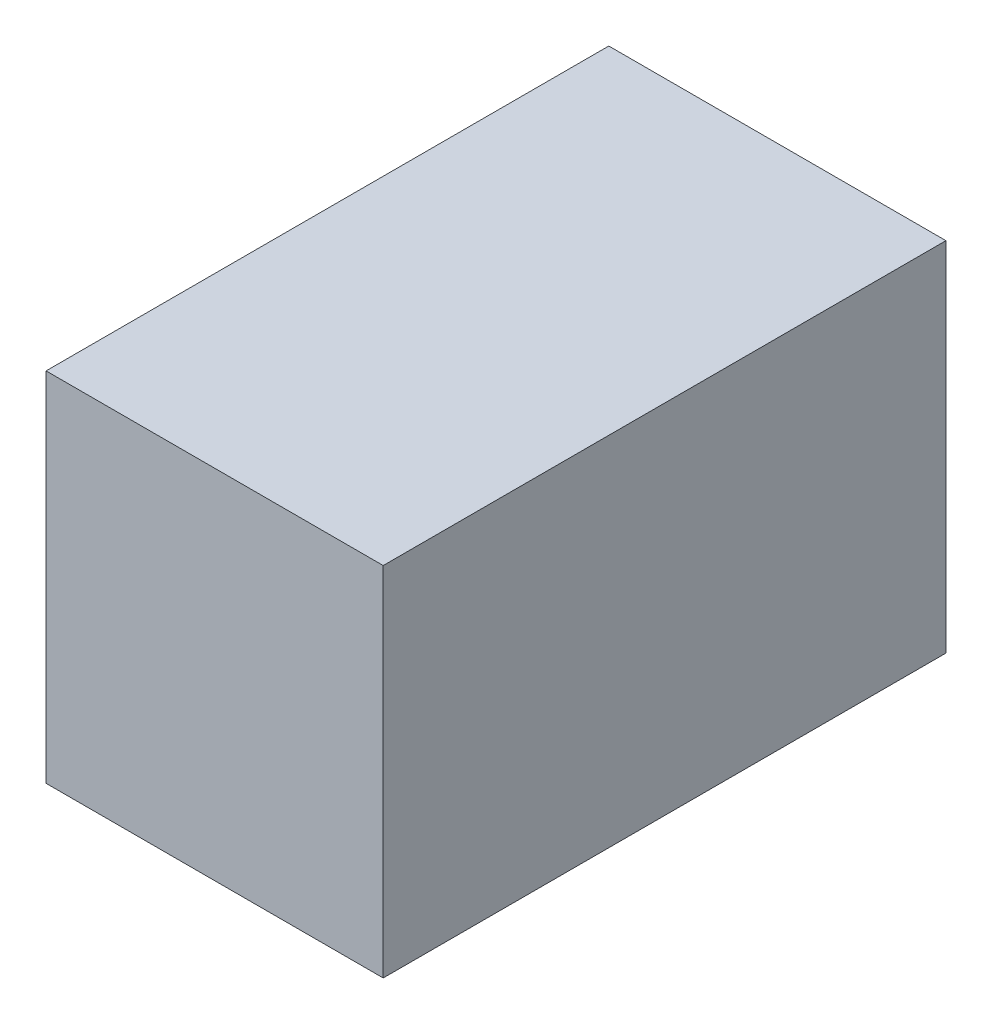
ISO-10303-21;
HEADER;
FILE_DESCRIPTION(('STEP AP214'),'2;1');
FILE_NAME('part.step','',(''),(''),'','','');
FILE_SCHEMA(('AUTOMOTIVE_DESIGN { 1 0 10303 214 1 1 1 1 }'));
ENDSEC;
DATA;
#1=APPLICATION_CONTEXT('core data for automotive mechanical design processes');
#2=APPLICATION_PROTOCOL_DEFINITION('international standard','automotive_design',2000,#1);
#3=PRODUCT_CONTEXT('',#1,'mechanical');
#4=PRODUCT('Part','Part','',(#3));
#5=PRODUCT_RELATED_PRODUCT_CATEGORY('part','',(#4));
#6=PRODUCT_DEFINITION_FORMATION('','',#4);
#7=PRODUCT_DEFINITION_CONTEXT('part definition',#1,'design');
#8=PRODUCT_DEFINITION('design','',#6,#7);
#9=PRODUCT_DEFINITION_SHAPE('','',#8);
#10=(LENGTH_UNIT() NAMED_UNIT(*) SI_UNIT(.MILLI.,.METRE.));
#11=(NAMED_UNIT(*) PLANE_ANGLE_UNIT() SI_UNIT($,.RADIAN.));
#12=(NAMED_UNIT(*) SI_UNIT($,.STERADIAN.) SOLID_ANGLE_UNIT());
#13=UNCERTAINTY_MEASURE_WITH_UNIT(LENGTH_MEASURE(1.E-05),#10,'distance_accuracy_value','');
#14=(GEOMETRIC_REPRESENTATION_CONTEXT(3) GLOBAL_UNCERTAINTY_ASSIGNED_CONTEXT((#13)) GLOBAL_UNIT_ASSIGNED_CONTEXT((#10,
#11,#12)) REPRESENTATION_CONTEXT('',''));
#15=CARTESIAN_POINT('',(0.,0.,0.));
#16=DIRECTION('',(0.,0.,1.));
#17=DIRECTION('',(1.,0.,0.));
#18=AXIS2_PLACEMENT_3D('',#15,#16,#17);
#19=CARTESIAN_POINT('',(19.,9.125,-17.525));
#20=DIRECTION('',(0.,0.,1.));
#21=DIRECTION('',(0.,-1.,0.));
#22=AXIS2_PLACEMENT_3D('',#19,#20,#21);
#23=PLANE('',#22);
#24=DIRECTION('',(0.,-1.,0.));
#25=VECTOR('',#24,1.);
#26=CARTESIAN_POINT('',(12.,9.125,-17.525));
#27=LINE('',#26,#25);
#28=CARTESIAN_POINT('',(12.,9.125,-17.525));
#29=VERTEX_POINT('',#28);
#30=CARTESIAN_POINT('',(12.,-9.125,-17.525));
#31=VERTEX_POINT('',#30);
#32=EDGE_CURVE('E202',#29,#31,#27,.T.);
#33=ORIENTED_EDGE('',*,*,#32,.F.);
#34=DIRECTION('',(1.,0.,0.));
#35=VECTOR('',#34,1.);
#36=CARTESIAN_POINT('',(0.,9.125,-17.525));
#37=LINE('',#36,#35);
#38=CARTESIAN_POINT('',(0.,9.125,-17.525));
#39=VERTEX_POINT('',#38);
#40=EDGE_CURVE('E206',#39,#29,#37,.T.);
#41=ORIENTED_EDGE('',*,*,#40,.F.);
#42=DIRECTION('',(0.,1.,0.));
#43=VECTOR('',#42,1.);
#44=CARTESIAN_POINT('',(0.,9.125,-17.525));
#45=LINE('',#44,#43);
#46=CARTESIAN_POINT('',(0.,11.125,-17.525));
#47=VERTEX_POINT('',#46);
#48=EDGE_CURVE('E92',#39,#47,#45,.T.);
#49=ORIENTED_EDGE('',*,*,#48,.T.);
#50=DIRECTION('',(-1.,0.,0.));
#51=VECTOR('',#50,1.);
#52=CARTESIAN_POINT('',(19.,11.125,-17.525));
#53=LINE('',#52,#51);
#54=CARTESIAN_POINT('',(21.,11.125,-17.525));
#55=VERTEX_POINT('',#54);
#56=EDGE_CURVE('E11',#55,#47,#53,.T.);
#57=ORIENTED_EDGE('',*,*,#56,.F.);
#58=DIRECTION('',(0.,1.,0.));
#59=VECTOR('',#58,1.);
#60=CARTESIAN_POINT('',(21.,9.125,-17.525));
#61=LINE('',#60,#59);
#62=CARTESIAN_POINT('',(21.,-11.125,-17.525));
#63=VERTEX_POINT('',#62);
#64=EDGE_CURVE('E120',#63,#55,#61,.T.);
#65=ORIENTED_EDGE('',*,*,#64,.F.);
#66=DIRECTION('',(-1.,0.,0.));
#67=VECTOR('',#66,1.);
#68=CARTESIAN_POINT('',(19.,-11.125,-17.525));
#69=LINE('',#68,#67);
#70=CARTESIAN_POINT('',(0.,-11.125,-17.525));
#71=VERTEX_POINT('',#70);
#72=EDGE_CURVE('E136',#63,#71,#69,.T.);
#73=ORIENTED_EDGE('',*,*,#72,.T.);
#74=CARTESIAN_POINT('',(0.,-9.125,-17.525));
#75=VERTEX_POINT('',#74);
#76=EDGE_CURVE('E140',#71,#75,#45,.T.);
#77=ORIENTED_EDGE('',*,*,#76,.T.);
#78=DIRECTION('',(-1.,0.,0.));
#79=VECTOR('',#78,1.);
#80=CARTESIAN_POINT('',(12.,-9.125,-17.525));
#81=LINE('',#80,#79);
#82=EDGE_CURVE('E198',#31,#75,#81,.T.);
#83=ORIENTED_EDGE('',*,*,#82,.F.);
#84=EDGE_LOOP('',(#33,#41,#49,#57,#65,#73,#77,#83));
#85=FACE_BOUND('',#84,.T.);
#86=ADVANCED_FACE('F43',(#85),#23,.F.);
#87=CARTESIAN_POINT('',(19.,11.125,15.525));
#88=DIRECTION('',(0.,-1.,0.));
#89=DIRECTION('',(0.,0.,-1.));
#90=AXIS2_PLACEMENT_3D('',#87,#88,#89);
#91=PLANE('',#90);
#92=DIRECTION('',(0.,0.,1.));
#93=VECTOR('',#92,1.);
#94=CARTESIAN_POINT('',(0.,11.125,15.525));
#95=LINE('',#94,#93);
#96=CARTESIAN_POINT('',(0.,11.125,17.525));
#97=VERTEX_POINT('',#96);
#98=EDGE_CURVE('E47',#47,#97,#95,.T.);
#99=ORIENTED_EDGE('',*,*,#98,.T.);
#100=DIRECTION('',(-1.,0.,0.));
#101=VECTOR('',#100,1.);
#102=CARTESIAN_POINT('',(19.,11.125,17.525));
#103=LINE('',#102,#101);
#104=CARTESIAN_POINT('',(21.,11.125,17.525));
#105=VERTEX_POINT('',#104);
#106=EDGE_CURVE('E53',#105,#97,#103,.T.);
#107=ORIENTED_EDGE('',*,*,#106,.F.);
#108=DIRECTION('',(0.,0.,1.));
#109=VECTOR('',#108,1.);
#110=CARTESIAN_POINT('',(21.,11.125,15.525));
#111=LINE('',#110,#109);
#112=EDGE_CURVE('E114',#55,#105,#111,.T.);
#113=ORIENTED_EDGE('',*,*,#112,.F.);
#114=ORIENTED_EDGE('',*,*,#56,.T.);
#115=EDGE_LOOP('',(#99,#107,#113,#114));
#116=FACE_BOUND('',#115,.T.);
#117=ADVANCED_FACE('F125',(#116),#91,.F.);
#118=CARTESIAN_POINT('',(19.,9.125,17.525));
#119=DIRECTION('',(0.,0.,-1.));
#120=DIRECTION('',(0.,1.,0.));
#121=AXIS2_PLACEMENT_3D('',#118,#119,#120);
#122=PLANE('',#121);
#123=DIRECTION('',(0.,-1.,0.));
#124=VECTOR('',#123,1.);
#125=CARTESIAN_POINT('',(0.,9.125,17.525));
#126=LINE('',#125,#124);
#127=CARTESIAN_POINT('',(0.,-11.125,17.525));
#128=VERTEX_POINT('',#127);
#129=EDGE_CURVE('E146',#97,#128,#126,.T.);
#130=ORIENTED_EDGE('',*,*,#129,.T.);
#131=DIRECTION('',(-1.,0.,0.));
#132=VECTOR('',#131,1.);
#133=CARTESIAN_POINT('',(19.,-11.125,17.525));
#134=LINE('',#133,#132);
#135=CARTESIAN_POINT('',(21.,-11.125,17.525));
#136=VERTEX_POINT('',#135);
#137=EDGE_CURVE('E129',#136,#128,#134,.T.);
#138=ORIENTED_EDGE('',*,*,#137,.F.);
#139=DIRECTION('',(0.,-1.,0.));
#140=VECTOR('',#139,1.);
#141=CARTESIAN_POINT('',(21.,9.125,17.525));
#142=LINE('',#141,#140);
#143=EDGE_CURVE('E117',#105,#136,#142,.T.);
#144=ORIENTED_EDGE('',*,*,#143,.F.);
#145=ORIENTED_EDGE('',*,*,#106,.T.);
#146=EDGE_LOOP('',(#130,#138,#144,#145));
#147=FACE_BOUND('',#146,.T.);
#148=ADVANCED_FACE('F131',(#147),#122,.F.);
#149=CARTESIAN_POINT('',(19.,-11.125,15.525));
#150=DIRECTION('',(0.,1.,0.));
#151=DIRECTION('',(0.,0.,1.));
#152=AXIS2_PLACEMENT_3D('',#149,#150,#151);
#153=PLANE('',#152);
#154=DIRECTION('',(0.,0.,-1.));
#155=VECTOR('',#154,1.);
#156=CARTESIAN_POINT('',(0.,-11.125,15.525));
#157=LINE('',#156,#155);
#158=EDGE_CURVE('E144',#128,#71,#157,.T.);
#159=ORIENTED_EDGE('',*,*,#158,.T.);
#160=ORIENTED_EDGE('',*,*,#72,.F.);
#161=DIRECTION('',(0.,0.,-1.));
#162=VECTOR('',#161,1.);
#163=CARTESIAN_POINT('',(21.,-11.125,15.525));
#164=LINE('',#163,#162);
#165=EDGE_CURVE('E70',#136,#63,#164,.T.);
#166=ORIENTED_EDGE('',*,*,#165,.F.);
#167=ORIENTED_EDGE('',*,*,#137,.T.);
#168=EDGE_LOOP('',(#159,#160,#166,#167));
#169=FACE_BOUND('',#168,.T.);
#170=ADVANCED_FACE('F224',(#169),#153,.F.);
#171=CARTESIAN_POINT('',(21.,0.,0.));
#172=DIRECTION('',(1.,0.,0.));
#173=DIRECTION('',(0.,0.,-1.));
#174=AXIS2_PLACEMENT_3D('',#171,#172,#173);
#175=PLANE('',#174);
#176=ORIENTED_EDGE('',*,*,#64,.T.);
#177=ORIENTED_EDGE('',*,*,#112,.T.);
#178=ORIENTED_EDGE('',*,*,#143,.T.);
#179=ORIENTED_EDGE('',*,*,#165,.T.);
#180=EDGE_LOOP('',(#176,#177,#178,#179));
#181=FACE_BOUND('',#180,.T.);
#182=ADVANCED_FACE('F45',(#181),#175,.T.);
#183=CARTESIAN_POINT('',(0.,0.,0.));
#184=DIRECTION('',(1.,0.,0.));
#185=DIRECTION('',(0.,0.,-1.));
#186=AXIS2_PLACEMENT_3D('',#183,#184,#185);
#187=PLANE('',#186);
#188=ORIENTED_EDGE('',*,*,#48,.F.);
#189=DIRECTION('',(0.,0.,1.));
#190=VECTOR('',#189,1.);
#191=CARTESIAN_POINT('',(0.,9.125,15.525));
#192=LINE('',#191,#190);
#193=CARTESIAN_POINT('',(0.,9.125,15.525));
#194=VERTEX_POINT('',#193);
#195=EDGE_CURVE('E182',#39,#194,#192,.T.);
#196=ORIENTED_EDGE('',*,*,#195,.T.);
#197=DIRECTION('',(0.,-1.,0.));
#198=VECTOR('',#197,1.);
#199=CARTESIAN_POINT('',(0.,9.125,15.525));
#200=LINE('',#199,#198);
#201=CARTESIAN_POINT('',(0.,-9.125,15.525));
#202=VERTEX_POINT('',#201);
#203=EDGE_CURVE('E61',#194,#202,#200,.T.);
#204=ORIENTED_EDGE('',*,*,#203,.T.);
#205=DIRECTION('',(0.,0.,-1.));
#206=VECTOR('',#205,1.);
#207=CARTESIAN_POINT('',(0.,-9.125,15.525));
#208=LINE('',#207,#206);
#209=EDGE_CURVE('E176',#202,#75,#208,.T.);
#210=ORIENTED_EDGE('',*,*,#209,.T.);
#211=ORIENTED_EDGE('',*,*,#76,.F.);
#212=ORIENTED_EDGE('',*,*,#158,.F.);
#213=ORIENTED_EDGE('',*,*,#129,.F.);
#214=ORIENTED_EDGE('',*,*,#98,.F.);
#215=EDGE_LOOP('',(#188,#196,#204,#210,#211,#212,#213,#214));
#216=FACE_BOUND('',#215,.T.);
#217=ADVANCED_FACE('F226',(#216),#187,.F.);
#218=CARTESIAN_POINT('',(19.,9.125,-15.525));
#219=DIRECTION('',(0.,0.,1.));
#220=DIRECTION('',(0.,-1.,0.));
#221=AXIS2_PLACEMENT_3D('',#218,#219,#220);
#222=PLANE('',#221);
#223=DIRECTION('',(0.,-1.,0.));
#224=VECTOR('',#223,1.);
#225=CARTESIAN_POINT('',(12.,9.125,-15.525));
#226=LINE('',#225,#224);
#227=CARTESIAN_POINT('',(12.,9.125,-15.525));
#228=VERTEX_POINT('',#227);
#229=CARTESIAN_POINT('',(12.,-9.125,-15.525));
#230=VERTEX_POINT('',#229);
#231=EDGE_CURVE('E190',#228,#230,#226,.T.);
#232=ORIENTED_EDGE('',*,*,#231,.T.);
#233=DIRECTION('',(-1.,0.,0.));
#234=VECTOR('',#233,1.);
#235=CARTESIAN_POINT('',(19.,-9.125,-15.525));
#236=LINE('',#235,#234);
#237=CARTESIAN_POINT('',(19.,-9.125,-15.525));
#238=VERTEX_POINT('',#237);
#239=EDGE_CURVE('E160',#238,#230,#236,.T.);
#240=ORIENTED_EDGE('',*,*,#239,.F.);
#241=DIRECTION('',(0.,1.,0.));
#242=VECTOR('',#241,1.);
#243=CARTESIAN_POINT('',(19.,9.125,-15.525));
#244=LINE('',#243,#242);
#245=CARTESIAN_POINT('',(19.,9.125,-15.525));
#246=VERTEX_POINT('',#245);
#247=EDGE_CURVE('E172',#238,#246,#244,.T.);
#248=ORIENTED_EDGE('',*,*,#247,.T.);
#249=DIRECTION('',(-1.,0.,0.));
#250=VECTOR('',#249,1.);
#251=CARTESIAN_POINT('',(19.,9.125,-15.525));
#252=LINE('',#251,#250);
#253=EDGE_CURVE('E151',#246,#228,#252,.T.);
#254=ORIENTED_EDGE('',*,*,#253,.T.);
#255=EDGE_LOOP('',(#232,#240,#248,#254));
#256=FACE_BOUND('',#255,.T.);
#257=ADVANCED_FACE('F250',(#256),#222,.T.);
#258=CARTESIAN_POINT('',(19.,9.125,15.525));
#259=DIRECTION('',(0.,-1.,0.));
#260=DIRECTION('',(0.,0.,-1.));
#261=AXIS2_PLACEMENT_3D('',#258,#259,#260);
#262=PLANE('',#261);
#263=ORIENTED_EDGE('',*,*,#195,.F.);
#264=ORIENTED_EDGE('',*,*,#40,.T.);
#265=DIRECTION('',(0.,0.,-1.));
#266=VECTOR('',#265,1.);
#267=CARTESIAN_POINT('',(12.,9.125,6.31676046018268));
#268=LINE('',#267,#266);
#269=EDGE_CURVE('E194',#228,#29,#268,.T.);
#270=ORIENTED_EDGE('',*,*,#269,.F.);
#271=ORIENTED_EDGE('',*,*,#253,.F.);
#272=DIRECTION('',(0.,0.,1.));
#273=VECTOR('',#272,1.);
#274=CARTESIAN_POINT('',(19.,9.125,15.525));
#275=LINE('',#274,#273);
#276=CARTESIAN_POINT('',(19.,9.125,15.525));
#277=VERTEX_POINT('',#276);
#278=EDGE_CURVE('E168',#246,#277,#275,.T.);
#279=ORIENTED_EDGE('',*,*,#278,.T.);
#280=DIRECTION('',(-1.,0.,0.));
#281=VECTOR('',#280,1.);
#282=CARTESIAN_POINT('',(19.,9.125,15.525));
#283=LINE('',#282,#281);
#284=EDGE_CURVE('E154',#277,#194,#283,.T.);
#285=ORIENTED_EDGE('',*,*,#284,.T.);
#286=EDGE_LOOP('',(#263,#264,#270,#271,#279,#285));
#287=FACE_BOUND('',#286,.T.);
#288=ADVANCED_FACE('F243',(#287),#262,.T.);
#289=CARTESIAN_POINT('',(19.,9.125,15.525));
#290=DIRECTION('',(0.,0.,-1.));
#291=DIRECTION('',(0.,1.,0.));
#292=AXIS2_PLACEMENT_3D('',#289,#290,#291);
#293=PLANE('',#292);
#294=ORIENTED_EDGE('',*,*,#203,.F.);
#295=ORIENTED_EDGE('',*,*,#284,.F.);
#296=DIRECTION('',(0.,-1.,0.));
#297=VECTOR('',#296,1.);
#298=CARTESIAN_POINT('',(19.,9.125,15.525));
#299=LINE('',#298,#297);
#300=CARTESIAN_POINT('',(19.,-9.125,15.525));
#301=VERTEX_POINT('',#300);
#302=EDGE_CURVE('E165',#277,#301,#299,.T.);
#303=ORIENTED_EDGE('',*,*,#302,.T.);
#304=DIRECTION('',(-1.,0.,0.));
#305=VECTOR('',#304,1.);
#306=CARTESIAN_POINT('',(19.,-9.125,15.525));
#307=LINE('',#306,#305);
#308=EDGE_CURVE('E157',#301,#202,#307,.T.);
#309=ORIENTED_EDGE('',*,*,#308,.T.);
#310=EDGE_LOOP('',(#294,#295,#303,#309));
#311=FACE_BOUND('',#310,.T.);
#312=ADVANCED_FACE('F247',(#311),#293,.T.);
#313=CARTESIAN_POINT('',(19.,-9.125,15.525));
#314=DIRECTION('',(0.,1.,0.));
#315=DIRECTION('',(0.,0.,1.));
#316=AXIS2_PLACEMENT_3D('',#313,#314,#315);
#317=PLANE('',#316);
#318=ORIENTED_EDGE('',*,*,#209,.F.);
#319=ORIENTED_EDGE('',*,*,#308,.F.);
#320=DIRECTION('',(0.,0.,-1.));
#321=VECTOR('',#320,1.);
#322=CARTESIAN_POINT('',(19.,-9.125,15.525));
#323=LINE('',#322,#321);
#324=EDGE_CURVE('E101',#301,#238,#323,.T.);
#325=ORIENTED_EDGE('',*,*,#324,.T.);
#326=ORIENTED_EDGE('',*,*,#239,.T.);
#327=DIRECTION('',(0.,0.,-1.));
#328=VECTOR('',#327,1.);
#329=CARTESIAN_POINT('',(12.,-9.125,6.31676046018268));
#330=LINE('',#329,#328);
#331=EDGE_CURVE('E186',#230,#31,#330,.T.);
#332=ORIENTED_EDGE('',*,*,#331,.T.);
#333=ORIENTED_EDGE('',*,*,#82,.T.);
#334=EDGE_LOOP('',(#318,#319,#325,#326,#332,#333));
#335=FACE_BOUND('',#334,.T.);
#336=ADVANCED_FACE('F252',(#335),#317,.T.);
#337=CARTESIAN_POINT('',(19.,0.,0.));
#338=DIRECTION('',(1.,0.,0.));
#339=DIRECTION('',(0.,0.,-1.));
#340=AXIS2_PLACEMENT_3D('',#337,#338,#339);
#341=PLANE('',#340);
#342=ORIENTED_EDGE('',*,*,#247,.F.);
#343=ORIENTED_EDGE('',*,*,#324,.F.);
#344=ORIENTED_EDGE('',*,*,#302,.F.);
#345=ORIENTED_EDGE('',*,*,#278,.F.);
#346=EDGE_LOOP('',(#342,#343,#344,#345));
#347=FACE_BOUND('',#346,.T.);
#348=ADVANCED_FACE('F248',(#347),#341,.F.);
#349=CARTESIAN_POINT('',(12.,9.125,6.31676046018268));
#350=DIRECTION('',(1.,0.,0.));
#351=DIRECTION('',(0.,1.,0.));
#352=AXIS2_PLACEMENT_3D('',#349,#350,#351);
#353=PLANE('',#352);
#354=ORIENTED_EDGE('',*,*,#269,.T.);
#355=ORIENTED_EDGE('',*,*,#32,.T.);
#356=ORIENTED_EDGE('',*,*,#331,.F.);
#357=ORIENTED_EDGE('',*,*,#231,.F.);
#358=EDGE_LOOP('',(#354,#355,#356,#357));
#359=FACE_BOUND('',#358,.T.);
#360=ADVANCED_FACE('F254',(#359),#353,.F.);
#361=CLOSED_SHELL('',(#86,#117,#148,#170,#182,#217,#257,#288,#312,#336,#348,#360));
#362=MANIFOLD_SOLID_BREP('B2',#361);
#363=ADVANCED_BREP_SHAPE_REPRESENTATION('',(#18,#362),#14);
#364=SHAPE_DEFINITION_REPRESENTATION(#9,#363);
ENDSEC;
END-ISO-10303-21;
